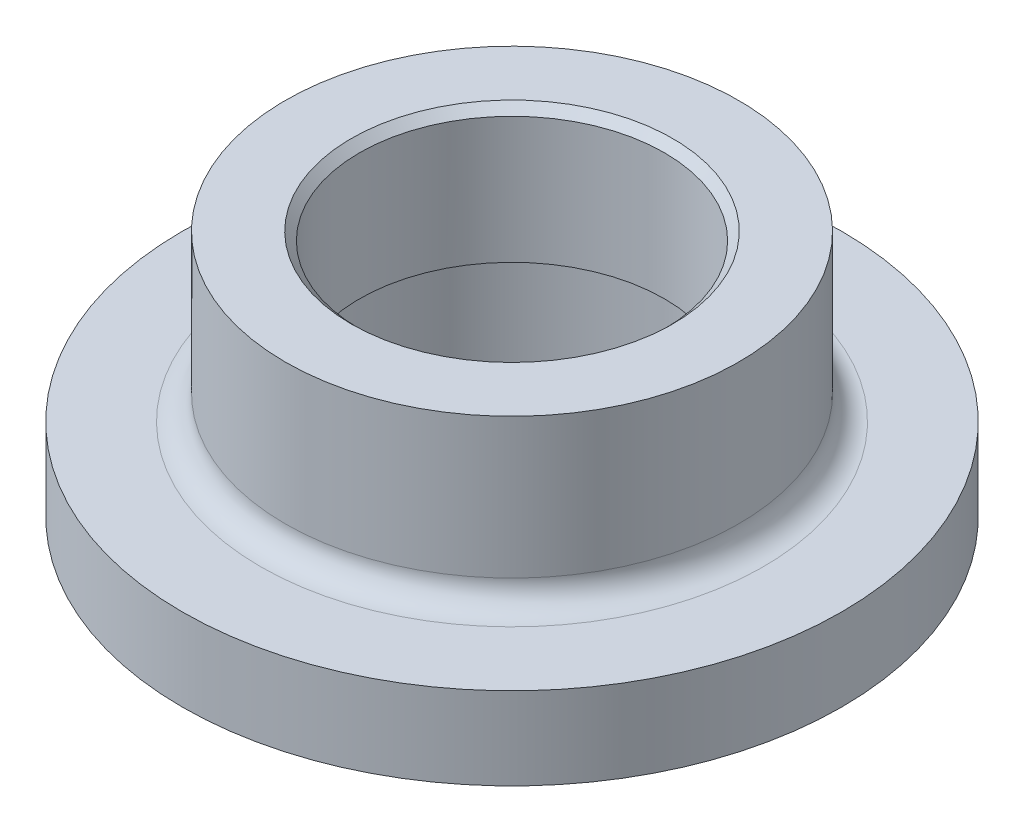
ISO-10303-21;
HEADER;
FILE_DESCRIPTION(('STEP AP214'),'2;1');
FILE_NAME('part.step','',(''),(''),'','','');
FILE_SCHEMA(('AUTOMOTIVE_DESIGN { 1 0 10303 214 1 1 1 1 }'));
ENDSEC;
DATA;
#1=APPLICATION_CONTEXT('core data for automotive mechanical design processes');
#2=APPLICATION_PROTOCOL_DEFINITION('international standard','automotive_design',2000,#1);
#3=PRODUCT_CONTEXT('',#1,'mechanical');
#4=PRODUCT('Part','Part','',(#3));
#5=PRODUCT_RELATED_PRODUCT_CATEGORY('part','',(#4));
#6=PRODUCT_DEFINITION_FORMATION('','',#4);
#7=PRODUCT_DEFINITION_CONTEXT('part definition',#1,'design');
#8=PRODUCT_DEFINITION('design','',#6,#7);
#9=PRODUCT_DEFINITION_SHAPE('','',#8);
#10=(LENGTH_UNIT() NAMED_UNIT(*) SI_UNIT(.MILLI.,.METRE.));
#11=(NAMED_UNIT(*) PLANE_ANGLE_UNIT() SI_UNIT($,.RADIAN.));
#12=(NAMED_UNIT(*) SI_UNIT($,.STERADIAN.) SOLID_ANGLE_UNIT());
#13=UNCERTAINTY_MEASURE_WITH_UNIT(LENGTH_MEASURE(1.E-05),#10,'distance_accuracy_value','');
#14=(GEOMETRIC_REPRESENTATION_CONTEXT(3) GLOBAL_UNCERTAINTY_ASSIGNED_CONTEXT((#13)) GLOBAL_UNIT_ASSIGNED_CONTEXT((#10,
#11,#12)) REPRESENTATION_CONTEXT('',''));
#15=CARTESIAN_POINT('',(0.,0.,0.));
#16=DIRECTION('',(0.,0.,1.));
#17=DIRECTION('',(1.,0.,0.));
#18=AXIS2_PLACEMENT_3D('',#15,#16,#17);
#19=CARTESIAN_POINT('',(0.,2.,0.));
#20=DIRECTION('',(0.,-1.,0.));
#21=DIRECTION('',(0.,0.,-1.));
#22=AXIS2_PLACEMENT_3D('',#19,#20,#21);
#23=CYLINDRICAL_SURFACE('',#22,3.7);
#24=CARTESIAN_POINT('',(0.,2.73094010767585,0.));
#25=DIRECTION('',(0.,-1.,0.));
#26=DIRECTION('',(0.,0.,-1.));
#27=AXIS2_PLACEMENT_3D('',#24,#25,#26);
#28=CIRCLE('',#27,3.7);
#29=CARTESIAN_POINT('',(0.,2.73094010767585,-3.7));
#30=VERTEX_POINT('',#29);
#31=EDGE_CURVE('E10',#30,#30,#28,.T.);
#32=ORIENTED_EDGE('',*,*,#31,.T.);
#33=EDGE_LOOP('',(#32));
#34=FACE_BOUND('',#33,.T.);
#35=CARTESIAN_POINT('',(0.,5.79999999999999,0.));
#36=DIRECTION('',(0.,1.,0.));
#37=DIRECTION('',(0.,0.,1.));
#38=AXIS2_PLACEMENT_3D('',#35,#36,#37);
#39=CIRCLE('',#38,3.7);
#40=CARTESIAN_POINT('',(0.,5.79999999999999,3.7));
#41=VERTEX_POINT('',#40);
#42=EDGE_CURVE('E49',#41,#41,#39,.T.);
#43=ORIENTED_EDGE('',*,*,#42,.T.);
#44=EDGE_LOOP('',(#43));
#45=FACE_BOUND('',#44,.T.);
#46=ADVANCED_FACE('F37',(#34,#45),#23,.F.);
#47=CARTESIAN_POINT('',(0.,2.,0.));
#48=DIRECTION('',(0.,1.,0.));
#49=DIRECTION('',(0.,0.,1.));
#50=AXIS2_PLACEMENT_3D('',#47,#48,#49);
#51=PLANE('',#50);
#52=CARTESIAN_POINT('',(0.,2.,0.));
#53=DIRECTION('',(0.,1.,0.));
#54=DIRECTION('',(0.,0.,1.));
#55=AXIS2_PLACEMENT_3D('',#52,#53,#54);
#56=CIRCLE('',#55,6.1);
#57=CARTESIAN_POINT('',(0.,2.,6.1));
#58=VERTEX_POINT('',#57);
#59=EDGE_CURVE('E53',#58,#58,#56,.F.);
#60=ORIENTED_EDGE('',*,*,#59,.T.);
#61=EDGE_LOOP('',(#60));
#62=FACE_BOUND('',#61,.T.);
#63=CARTESIAN_POINT('',(0.,2.,0.));
#64=DIRECTION('',(0.,1.,0.));
#65=DIRECTION('',(0.,0.,1.));
#66=AXIS2_PLACEMENT_3D('',#63,#64,#65);
#67=CIRCLE('',#66,8.);
#68=CARTESIAN_POINT('',(0.,2.,8.));
#69=VERTEX_POINT('',#68);
#70=EDGE_CURVE('E61',#69,#69,#67,.T.);
#71=ORIENTED_EDGE('',*,*,#70,.T.);
#72=EDGE_LOOP('',(#71));
#73=FACE_BOUND('',#72,.T.);
#74=ADVANCED_FACE('F90',(#62,#73),#51,.T.);
#75=CARTESIAN_POINT('',(0.,0.,0.));
#76=DIRECTION('',(0.,1.,0.));
#77=DIRECTION('',(0.,0.,1.));
#78=AXIS2_PLACEMENT_3D('',#75,#76,#77);
#79=PLANE('',#78);
#80=CARTESIAN_POINT('',(0.,0.,0.));
#81=DIRECTION('',(0.,-1.,0.));
#82=DIRECTION('',(0.,0.,-1.));
#83=AXIS2_PLACEMENT_3D('',#80,#81,#82);
#84=CIRCLE('',#83,4.1);
#85=CARTESIAN_POINT('',(0.,0.,-4.1));
#86=VERTEX_POINT('',#85);
#87=EDGE_CURVE('E71',#86,#86,#84,.T.);
#88=ORIENTED_EDGE('',*,*,#87,.F.);
#89=EDGE_LOOP('',(#88));
#90=FACE_BOUND('',#89,.T.);
#91=CARTESIAN_POINT('',(0.,0.,0.));
#92=DIRECTION('',(0.,1.,0.));
#93=DIRECTION('',(0.,0.,1.));
#94=AXIS2_PLACEMENT_3D('',#91,#92,#93);
#95=CIRCLE('',#94,8.);
#96=CARTESIAN_POINT('',(0.,0.,8.));
#97=VERTEX_POINT('',#96);
#98=EDGE_CURVE('E62',#97,#97,#95,.T.);
#99=ORIENTED_EDGE('',*,*,#98,.F.);
#100=EDGE_LOOP('',(#99));
#101=FACE_BOUND('',#100,.T.);
#102=ADVANCED_FACE('F86',(#90,#101),#79,.F.);
#103=CARTESIAN_POINT('',(0.,2.,0.));
#104=DIRECTION('',(0.,-1.,0.));
#105=DIRECTION('',(0.,0.,-1.));
#106=AXIS2_PLACEMENT_3D('',#103,#104,#105);
#107=CYLINDRICAL_SURFACE('',#106,8.);
#108=ORIENTED_EDGE('',*,*,#70,.F.);
#109=EDGE_LOOP('',(#108));
#110=FACE_BOUND('',#109,.T.);
#111=ORIENTED_EDGE('',*,*,#98,.T.);
#112=EDGE_LOOP('',(#111));
#113=FACE_BOUND('',#112,.T.);
#114=ADVANCED_FACE('F89',(#110,#113),#107,.T.);
#115=CARTESIAN_POINT('',(0.,6.,0.));
#116=DIRECTION('',(0.,1.,0.));
#117=DIRECTION('',(0.,0.,1.));
#118=AXIS2_PLACEMENT_3D('',#115,#116,#117);
#119=PLANE('',#118);
#120=CARTESIAN_POINT('',(0.,6.,0.));
#121=DIRECTION('',(0.,1.,0.));
#122=DIRECTION('',(0.,0.,1.));
#123=AXIS2_PLACEMENT_3D('',#120,#121,#122);
#124=CIRCLE('',#123,3.90000000000001);
#125=CARTESIAN_POINT('',(0.,6.,3.90000000000001));
#126=VERTEX_POINT('',#125);
#127=EDGE_CURVE('E45',#126,#126,#124,.F.);
#128=ORIENTED_EDGE('',*,*,#127,.T.);
#129=EDGE_LOOP('',(#128));
#130=FACE_BOUND('',#129,.T.);
#131=CARTESIAN_POINT('',(0.,6.,0.));
#132=DIRECTION('',(0.,1.,0.));
#133=DIRECTION('',(0.,0.,1.));
#134=AXIS2_PLACEMENT_3D('',#131,#132,#133);
#135=CIRCLE('',#134,5.5);
#136=CARTESIAN_POINT('',(0.,6.,5.5));
#137=VERTEX_POINT('',#136);
#138=EDGE_CURVE('E65',#137,#137,#135,.T.);
#139=ORIENTED_EDGE('',*,*,#138,.T.);
#140=EDGE_LOOP('',(#139));
#141=FACE_BOUND('',#140,.T.);
#142=ADVANCED_FACE('F95',(#130,#141),#119,.T.);
#143=CARTESIAN_POINT('',(0.,6.,0.));
#144=DIRECTION('',(0.,-1.,0.));
#145=DIRECTION('',(0.,0.,-1.));
#146=AXIS2_PLACEMENT_3D('',#143,#144,#145);
#147=CYLINDRICAL_SURFACE('',#146,5.5);
#148=CARTESIAN_POINT('',(0.,2.6,0.));
#149=DIRECTION('',(0.,1.,0.));
#150=DIRECTION('',(0.,0.,1.));
#151=AXIS2_PLACEMENT_3D('',#148,#149,#150);
#152=CIRCLE('',#151,5.5);
#153=CARTESIAN_POINT('',(0.,2.6,5.5));
#154=VERTEX_POINT('',#153);
#155=EDGE_CURVE('E58',#154,#154,#152,.T.);
#156=ORIENTED_EDGE('',*,*,#155,.T.);
#157=EDGE_LOOP('',(#156));
#158=FACE_BOUND('',#157,.T.);
#159=ORIENTED_EDGE('',*,*,#138,.F.);
#160=EDGE_LOOP('',(#159));
#161=FACE_BOUND('',#160,.T.);
#162=ADVANCED_FACE('F101',(#158,#161),#147,.T.);
#163=CARTESIAN_POINT('',(0.,2.6,0.));
#164=DIRECTION('',(0.,1.,0.));
#165=DIRECTION('',(0.,0.,1.));
#166=AXIS2_PLACEMENT_3D('',#163,#164,#165);
#167=TOROIDAL_SURFACE('',#166,6.1,0.6);
#168=ORIENTED_EDGE('',*,*,#59,.F.);
#169=EDGE_LOOP('',(#168));
#170=FACE_BOUND('',#169,.T.);
#171=ORIENTED_EDGE('',*,*,#155,.F.);
#172=EDGE_LOOP('',(#171));
#173=FACE_BOUND('',#172,.T.);
#174=ADVANCED_FACE('F115',(#170,#173),#167,.F.);
#175=CARTESIAN_POINT('',(0.,5.79999999999999,0.));
#176=DIRECTION('',(0.,1.,0.));
#177=DIRECTION('',(0.,0.,1.));
#178=AXIS2_PLACEMENT_3D('',#175,#176,#177);
#179=CONICAL_SURFACE('',#178,3.7,0.78539816339746);
#180=ORIENTED_EDGE('',*,*,#127,.F.);
#181=EDGE_LOOP('',(#180));
#182=FACE_BOUND('',#181,.T.);
#183=ORIENTED_EDGE('',*,*,#42,.F.);
#184=EDGE_LOOP('',(#183));
#185=FACE_BOUND('',#184,.T.);
#186=ADVANCED_FACE('F82',(#182,#185),#179,.F.);
#187=CARTESIAN_POINT('',(0.,2.5,0.));
#188=DIRECTION('',(0.,-1.,0.));
#189=DIRECTION('',(0.,0.,-1.));
#190=AXIS2_PLACEMENT_3D('',#187,#188,#189);
#191=CYLINDRICAL_SURFACE('',#190,4.1);
#192=CARTESIAN_POINT('',(0.,2.5,0.));
#193=DIRECTION('',(0.,-1.,0.));
#194=DIRECTION('',(0.,0.,-1.));
#195=AXIS2_PLACEMENT_3D('',#192,#193,#194);
#196=CIRCLE('',#195,4.1);
#197=CARTESIAN_POINT('',(0.,2.5,-4.1));
#198=VERTEX_POINT('',#197);
#199=EDGE_CURVE('E70',#198,#198,#196,.T.);
#200=ORIENTED_EDGE('',*,*,#199,.F.);
#201=EDGE_LOOP('',(#200));
#202=FACE_BOUND('',#201,.T.);
#203=ORIENTED_EDGE('',*,*,#87,.T.);
#204=EDGE_LOOP('',(#203));
#205=FACE_BOUND('',#204,.T.);
#206=ADVANCED_FACE('F79',(#202,#205),#191,.F.);
#207=CARTESIAN_POINT('',(0.,2.73094010767585,0.));
#208=DIRECTION('',(0.,-1.,0.));
#209=DIRECTION('',(0.,0.,-1.));
#210=AXIS2_PLACEMENT_3D('',#207,#208,#209);
#211=CONICAL_SURFACE('',#210,3.7,1.0471975511966);
#212=CARTESIAN_POINT('',(0.,2.5,-4.1));
#213=CARTESIAN_POINT('',(0.,2.50240562612162,-4.09583333333333));
#214=CARTESIAN_POINT('',(0.,2.50481125224325,-4.09166666666667));
#215=CARTESIAN_POINT('',(0.,2.50962250448649,-4.08333333333333));
#216=CARTESIAN_POINT('',(0.,2.51202813060812,-4.07916666666667));
#217=CARTESIAN_POINT('',(0.,2.51683938285136,-4.07083333333333));
#218=CARTESIAN_POINT('',(0.,2.51924500897299,-4.06666666666667));
#219=CARTESIAN_POINT('',(0.,2.52405626121623,-4.05833333333333));
#220=CARTESIAN_POINT('',(0.,2.52646188733786,-4.05416666666667));
#221=CARTESIAN_POINT('',(0.,2.5312731395811,-4.04583333333333));
#222=CARTESIAN_POINT('',(0.,2.53367876570273,-4.04166666666667));
#223=CARTESIAN_POINT('',(0.,2.53849001794597,-4.03333333333333));
#224=CARTESIAN_POINT('',(0.,2.5408956440676,-4.02916666666667));
#225=CARTESIAN_POINT('',(0.,2.54570689631085,-4.02083333333333));
#226=CARTESIAN_POINT('',(0.,2.54811252243247,-4.01666666666667));
#227=CARTESIAN_POINT('',(0.,2.55292377467572,-4.00833333333333));
#228=CARTESIAN_POINT('',(0.,2.55532940079734,-4.00416666666667));
#229=CARTESIAN_POINT('',(0.,2.56014065304059,-3.99583333333333));
#230=CARTESIAN_POINT('',(0.,2.56254627916221,-3.99166666666667));
#231=CARTESIAN_POINT('',(0.,2.56735753140546,-3.98333333333333));
#232=CARTESIAN_POINT('',(0.,2.56976315752708,-3.97916666666667));
#233=CARTESIAN_POINT('',(0.,2.57457440977033,-3.97083333333333));
#234=CARTESIAN_POINT('',(0.,2.57698003589195,-3.96666666666667));
#235=CARTESIAN_POINT('',(0.,2.5817912881352,-3.95833333333333));
#236=CARTESIAN_POINT('',(0.,2.58419691425682,-3.95416666666667));
#237=CARTESIAN_POINT('',(0.,2.58900816650007,-3.94583333333333));
#238=CARTESIAN_POINT('',(0.,2.59141379262169,-3.94166666666667));
#239=CARTESIAN_POINT('',(0.,2.59622504486494,-3.93333333333333));
#240=CARTESIAN_POINT('',(0.,2.59863067098656,-3.92916666666667));
#241=CARTESIAN_POINT('',(0.,2.60344192322981,-3.92083333333333));
#242=CARTESIAN_POINT('',(0.,2.60584754935143,-3.91666666666667));
#243=CARTESIAN_POINT('',(0.,2.61065880159468,-3.90833333333333));
#244=CARTESIAN_POINT('',(0.,2.6130644277163,-3.90416666666667));
#245=CARTESIAN_POINT('',(0.,2.61787567995955,-3.89583333333333));
#246=CARTESIAN_POINT('',(0.,2.62028130608117,-3.89166666666667));
#247=CARTESIAN_POINT('',(0.,2.62509255832442,-3.88333333333333));
#248=CARTESIAN_POINT('',(0.,2.62749818444604,-3.87916666666667));
#249=CARTESIAN_POINT('',(0.,2.63230943668929,-3.87083333333333));
#250=CARTESIAN_POINT('',(0.,2.63471506281091,-3.86666666666667));
#251=CARTESIAN_POINT('',(0.,2.63952631505416,-3.85833333333333));
#252=CARTESIAN_POINT('',(0.,2.64193194117578,-3.85416666666667));
#253=CARTESIAN_POINT('',(0.,2.64674319341903,-3.84583333333333));
#254=CARTESIAN_POINT('',(0.,2.64914881954065,-3.84166666666667));
#255=CARTESIAN_POINT('',(0.,2.6539600717839,-3.83333333333333));
#256=CARTESIAN_POINT('',(0.,2.65636569790552,-3.82916666666667));
#257=CARTESIAN_POINT('',(0.,2.66117695014877,-3.82083333333333));
#258=CARTESIAN_POINT('',(0.,2.66358257627039,-3.81666666666667));
#259=CARTESIAN_POINT('',(0.,2.66839382851364,-3.80833333333333));
#260=CARTESIAN_POINT('',(0.,2.67079945463526,-3.80416666666667));
#261=CARTESIAN_POINT('',(0.,2.67561070687851,-3.79583333333333));
#262=CARTESIAN_POINT('',(0.,2.67801633300013,-3.79166666666667));
#263=CARTESIAN_POINT('',(0.,2.68282758524338,-3.78333333333333));
#264=CARTESIAN_POINT('',(0.,2.685233211365,-3.77916666666667));
#265=CARTESIAN_POINT('',(0.,2.69004446360825,-3.77083333333333));
#266=CARTESIAN_POINT('',(0.,2.69245008972988,-3.76666666666667));
#267=CARTESIAN_POINT('',(0.,2.69726134197312,-3.75833333333333));
#268=CARTESIAN_POINT('',(0.,2.69966696809475,-3.75416666666667));
#269=CARTESIAN_POINT('',(0.,2.70447822033799,-3.74583333333333));
#270=CARTESIAN_POINT('',(0.,2.70688384645962,-3.74166666666667));
#271=CARTESIAN_POINT('',(0.,2.71169509870286,-3.73333333333333));
#272=CARTESIAN_POINT('',(0.,2.71410072482449,-3.72916666666667));
#273=CARTESIAN_POINT('',(0.,2.71891197706773,-3.72083333333333));
#274=CARTESIAN_POINT('',(0.,2.72131760318936,-3.71666666666667));
#275=CARTESIAN_POINT('',(0.,2.7261288554326,-3.70833333333333));
#276=CARTESIAN_POINT('',(0.,2.72853448155423,-3.70416666666667));
#277=CARTESIAN_POINT('',(0.,2.73094010767585,-3.7));
#278=B_SPLINE_CURVE_WITH_KNOTS('',3,(#212,#213,#214,#215,#216,#217,#218,#219,#220,#221,#222,
#223,#224,#225,#226,#227,#228,#229,#230,#231,#232,#233,#234,#235,#236,#237,#238,#239,#240,#241,
#242,#243,#244,#245,#246,#247,#248,#249,#250,#251,#252,#253,#254,#255,#256,#257,#258,#259,#260,
#261,#262,#263,#264,#265,#266,#267,#268,#269,#270,#271,#272,#273,#274,#275,#276,#277),
.UNSPECIFIED.,.F.,.F.,(4,2,2,2,2,2,2,2,2,2,2,2,2,2,2,2,2,2,2,2,2,2,2,2,2,2,2,2,2,2,2,2,4),(0.,
0.014433756729741,0.0288675134594813,0.0433012701892223,0.057735026918963,0.0721687836487033,
0.0866025403784443,0.101036297108185,0.115470053837925,0.129903810567666,0.144337567297407,
0.158771324027147,0.173205080756888,0.187638837486629,0.202072594216369,0.21650635094611,
0.23094010767585,0.245373864405591,0.259807621135331,0.274241377865072,0.288675134594812,
0.303108891324553,0.317542648054294,0.331976404784034,0.346410161513775,0.360843918243515,
0.375277674973256,0.389711431702997,0.404145188432737,0.418578945162478,0.433012701892219,
0.447446458621959,0.4618802153517),.UNSPECIFIED.);
#279=EDGE_CURVE('BSEAM40',#198,#30,#278,.T.);
#280=ORIENTED_EDGE('',*,*,#199,.T.);
#281=ORIENTED_EDGE('',*,*,#31,.F.);
#282=ORIENTED_EDGE('',*,*,#279,.T.);
#283=ORIENTED_EDGE('',*,*,#279,.F.);
#284=EDGE_LOOP('',(#280,#282,#281,#283));
#285=FACE_BOUND('',#284,.T.);
#286=ADVANCED_FACE('F40',(#285),#211,.F.);
#287=CLOSED_SHELL('',(#46,#74,#102,#114,#142,#162,#174,#186,#206,#286));
#288=MANIFOLD_SOLID_BREP('B2',#287);
#289=ADVANCED_BREP_SHAPE_REPRESENTATION('',(#18,#288),#14);
#290=SHAPE_DEFINITION_REPRESENTATION(#9,#289);
ENDSEC;
END-ISO-10303-21;
